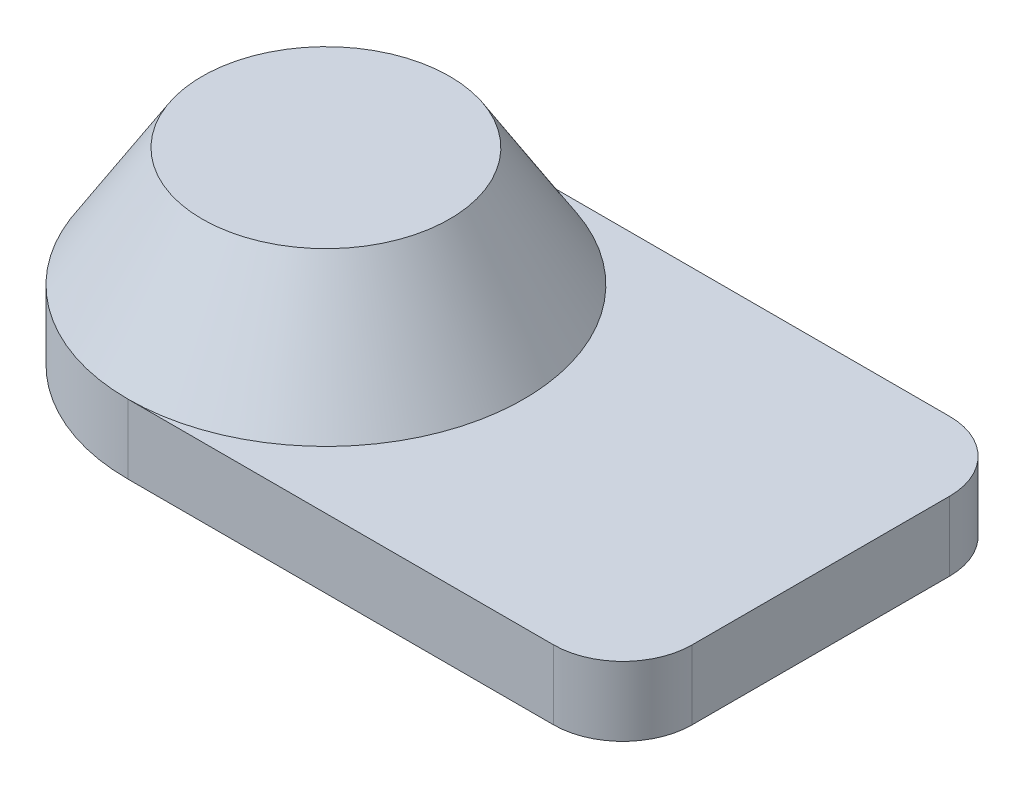
ISO-10303-21;
HEADER;
FILE_DESCRIPTION(('STEP AP214'),'2;1');
FILE_NAME('part.step','',(''),(''),'','','');
FILE_SCHEMA(('AUTOMOTIVE_DESIGN { 1 0 10303 214 1 1 1 1 }'));
ENDSEC;
DATA;
#1=APPLICATION_CONTEXT('core data for automotive mechanical design processes');
#2=APPLICATION_PROTOCOL_DEFINITION('international standard','automotive_design',2000,#1);
#3=PRODUCT_CONTEXT('',#1,'mechanical');
#4=PRODUCT('Part','Part','',(#3));
#5=PRODUCT_RELATED_PRODUCT_CATEGORY('part','',(#4));
#6=PRODUCT_DEFINITION_FORMATION('','',#4);
#7=PRODUCT_DEFINITION_CONTEXT('part definition',#1,'design');
#8=PRODUCT_DEFINITION('design','',#6,#7);
#9=PRODUCT_DEFINITION_SHAPE('','',#8);
#10=(LENGTH_UNIT() NAMED_UNIT(*) SI_UNIT(.MILLI.,.METRE.));
#11=(NAMED_UNIT(*) PLANE_ANGLE_UNIT() SI_UNIT($,.RADIAN.));
#12=(NAMED_UNIT(*) SI_UNIT($,.STERADIAN.) SOLID_ANGLE_UNIT());
#13=UNCERTAINTY_MEASURE_WITH_UNIT(LENGTH_MEASURE(1.E-05),#10,'distance_accuracy_value','');
#14=(GEOMETRIC_REPRESENTATION_CONTEXT(3) GLOBAL_UNCERTAINTY_ASSIGNED_CONTEXT((#13)) GLOBAL_UNIT_ASSIGNED_CONTEXT((#10,
#11,#12)) REPRESENTATION_CONTEXT('',''));
#15=CARTESIAN_POINT('',(0.,0.,0.));
#16=DIRECTION('',(0.,0.,1.));
#17=DIRECTION('',(1.,0.,0.));
#18=AXIS2_PLACEMENT_3D('',#15,#16,#17);
#19=CARTESIAN_POINT('',(0.,8.89,-25.4));
#20=DIRECTION('',(0.,1.,0.));
#21=DIRECTION('',(0.,0.,1.));
#22=AXIS2_PLACEMENT_3D('',#19,#20,#21);
#23=PLANE('',#22);
#24=DIRECTION('',(-1.,0.,0.));
#25=VECTOR('',#24,1.);
#26=CARTESIAN_POINT('',(0.,8.89,-50.8));
#27=LINE('',#26,#25);
#28=CARTESIAN_POINT('',(54.61,8.89,-50.8));
#29=VERTEX_POINT('',#28);
#30=CARTESIAN_POINT('',(0.000274441546231014,8.89,-50.8000000014871));
#31=VERTEX_POINT('',#30);
#32=EDGE_CURVE('E110',#29,#31,#27,.T.);
#33=ORIENTED_EDGE('',*,*,#32,.T.);
#34=CARTESIAN_POINT('',(0.,8.89,-25.4));
#35=DIRECTION('',(0.,1.,0.));
#36=DIRECTION('',(0.,0.,1.));
#37=AXIS2_PLACEMENT_3D('',#34,#35,#36);
#38=CIRCLE('',#37,25.4);
#39=CARTESIAN_POINT('',(0.,8.89,0.));
#40=VERTEX_POINT('',#39);
#41=EDGE_CURVE('E97',#40,#31,#38,.T.);
#42=ORIENTED_EDGE('',*,*,#41,.F.);
#43=DIRECTION('',(1.,0.,0.));
#44=VECTOR('',#43,1.);
#45=CARTESIAN_POINT('',(0.,8.89,0.));
#46=LINE('',#45,#44);
#47=CARTESIAN_POINT('',(54.61,8.89,0.));
#48=VERTEX_POINT('',#47);
#49=EDGE_CURVE('E131',#40,#48,#46,.T.);
#50=ORIENTED_EDGE('',*,*,#49,.T.);
#51=CARTESIAN_POINT('',(54.61,8.89,-8.89));
#52=DIRECTION('',(0.,1.,0.));
#53=DIRECTION('',(0.,0.,1.));
#54=AXIS2_PLACEMENT_3D('',#51,#52,#53);
#55=CIRCLE('',#54,8.89);
#56=CARTESIAN_POINT('',(63.5,8.89,-8.89));
#57=VERTEX_POINT('',#56);
#58=EDGE_CURVE('E196',#48,#57,#55,.T.);
#59=ORIENTED_EDGE('',*,*,#58,.T.);
#60=DIRECTION('',(0.,0.,-1.));
#61=VECTOR('',#60,1.);
#62=CARTESIAN_POINT('',(63.5,8.89,0.));
#63=LINE('',#62,#61);
#64=CARTESIAN_POINT('',(63.5,8.89,-41.91));
#65=VERTEX_POINT('',#64);
#66=EDGE_CURVE('E117',#57,#65,#63,.T.);
#67=ORIENTED_EDGE('',*,*,#66,.T.);
#68=CARTESIAN_POINT('',(54.61,8.89,-41.91));
#69=DIRECTION('',(0.,1.,0.));
#70=DIRECTION('',(0.,0.,1.));
#71=AXIS2_PLACEMENT_3D('',#68,#69,#70);
#72=CIRCLE('',#71,8.89);
#73=EDGE_CURVE('E50',#65,#29,#72,.T.);
#74=ORIENTED_EDGE('',*,*,#73,.T.);
#75=EDGE_LOOP('',(#33,#42,#50,#59,#67,#74));
#76=FACE_BOUND('',#75,.T.);
#77=ADVANCED_FACE('F41',(#76),#23,.T.);
#78=CARTESIAN_POINT('',(0.,8.89,-25.4));
#79=DIRECTION('',(0.,-1.,0.));
#80=DIRECTION('',(0.,0.,-1.));
#81=AXIS2_PLACEMENT_3D('',#78,#79,#80);
#82=CYLINDRICAL_SURFACE('',#81,25.4);
#83=CARTESIAN_POINT('',(0.,0.,-25.4));
#84=DIRECTION('',(0.,1.,0.));
#85=DIRECTION('',(0.,0.,1.));
#86=AXIS2_PLACEMENT_3D('',#83,#84,#85);
#87=CIRCLE('',#86,25.4);
#88=CARTESIAN_POINT('',(0.,0.,-50.8));
#89=VERTEX_POINT('',#88);
#90=CARTESIAN_POINT('',(0.,0.,0.));
#91=VERTEX_POINT('',#90);
#92=EDGE_CURVE('E207',#89,#91,#87,.T.);
#93=ORIENTED_EDGE('',*,*,#92,.T.);
#94=DIRECTION('',(0.,-1.,0.));
#95=VECTOR('',#94,1.);
#96=CARTESIAN_POINT('',(0.,8.89,0.));
#97=LINE('',#96,#95);
#98=EDGE_CURVE('E126',#40,#91,#97,.T.);
#99=ORIENTED_EDGE('',*,*,#98,.F.);
#100=CARTESIAN_POINT('',(0.,8.89,-25.4));
#101=DIRECTION('',(0.,-1.,0.));
#102=DIRECTION('',(0.,0.,-1.));
#103=AXIS2_PLACEMENT_3D('',#100,#101,#102);
#104=CIRCLE('',#103,25.4);
#105=EDGE_CURVE('E103',#31,#40,#104,.F.);
#106=ORIENTED_EDGE('',*,*,#105,.F.);
#107=DIRECTION('',(0.,-1.,0.));
#108=VECTOR('',#107,1.);
#109=CARTESIAN_POINT('',(0.,8.89,-50.8));
#110=LINE('',#109,#108);
#111=EDGE_CURVE('E116',#31,#89,#110,.T.);
#112=ORIENTED_EDGE('',*,*,#111,.T.);
#113=EDGE_LOOP('',(#93,#99,#106,#112));
#114=FACE_BOUND('',#113,.T.);
#115=ADVANCED_FACE('F129',(#114),#82,.T.);
#116=CARTESIAN_POINT('',(0.,8.89,0.));
#117=DIRECTION('',(0.,0.,-1.));
#118=DIRECTION('',(-1.,0.,0.));
#119=AXIS2_PLACEMENT_3D('',#116,#117,#118);
#120=PLANE('',#119);
#121=DIRECTION('',(1.,0.,0.));
#122=VECTOR('',#121,1.);
#123=CARTESIAN_POINT('',(0.,0.,0.));
#124=LINE('',#123,#122);
#125=CARTESIAN_POINT('',(54.61,0.,0.));
#126=VERTEX_POINT('',#125);
#127=EDGE_CURVE('E205',#91,#126,#124,.T.);
#128=ORIENTED_EDGE('',*,*,#127,.T.);
#129=DIRECTION('',(0.,-1.,0.));
#130=VECTOR('',#129,1.);
#131=CARTESIAN_POINT('',(54.61,8.89,0.));
#132=LINE('',#131,#130);
#133=EDGE_CURVE('E12',#126,#48,#132,.F.);
#134=ORIENTED_EDGE('',*,*,#133,.T.);
#135=ORIENTED_EDGE('',*,*,#49,.F.);
#136=ORIENTED_EDGE('',*,*,#98,.T.);
#137=EDGE_LOOP('',(#128,#134,#135,#136));
#138=FACE_BOUND('',#137,.T.);
#139=ADVANCED_FACE('F206',(#138),#120,.F.);
#140=CARTESIAN_POINT('',(63.5,8.89,0.));
#141=DIRECTION('',(-1.,0.,0.));
#142=DIRECTION('',(0.,0.,1.));
#143=AXIS2_PLACEMENT_3D('',#140,#141,#142);
#144=PLANE('',#143);
#145=DIRECTION('',(0.,0.,-1.));
#146=VECTOR('',#145,1.);
#147=CARTESIAN_POINT('',(63.5,0.,0.));
#148=LINE('',#147,#146);
#149=CARTESIAN_POINT('',(63.5,0.,-8.89));
#150=VERTEX_POINT('',#149);
#151=CARTESIAN_POINT('',(63.5,0.,-41.91));
#152=VERTEX_POINT('',#151);
#153=EDGE_CURVE('E133',#150,#152,#148,.T.);
#154=ORIENTED_EDGE('',*,*,#153,.T.);
#155=DIRECTION('',(0.,-1.,0.));
#156=VECTOR('',#155,1.);
#157=CARTESIAN_POINT('',(63.5,8.89,-41.91));
#158=LINE('',#157,#156);
#159=EDGE_CURVE('E64',#152,#65,#158,.F.);
#160=ORIENTED_EDGE('',*,*,#159,.T.);
#161=ORIENTED_EDGE('',*,*,#66,.F.);
#162=DIRECTION('',(0.,-1.,0.));
#163=VECTOR('',#162,1.);
#164=CARTESIAN_POINT('',(63.5,8.89,-8.89));
#165=LINE('',#164,#163);
#166=EDGE_CURVE('E192',#57,#150,#165,.T.);
#167=ORIENTED_EDGE('',*,*,#166,.T.);
#168=EDGE_LOOP('',(#154,#160,#161,#167));
#169=FACE_BOUND('',#168,.T.);
#170=ADVANCED_FACE('F201',(#169),#144,.F.);
#171=CARTESIAN_POINT('',(0.,8.89,-50.8));
#172=DIRECTION('',(0.,0.,1.));
#173=DIRECTION('',(1.,0.,0.));
#174=AXIS2_PLACEMENT_3D('',#171,#172,#173);
#175=PLANE('',#174);
#176=ORIENTED_EDGE('',*,*,#32,.F.);
#177=DIRECTION('',(0.,-1.,0.));
#178=VECTOR('',#177,1.);
#179=CARTESIAN_POINT('',(54.61,8.89,-50.8));
#180=LINE('',#179,#178);
#181=CARTESIAN_POINT('',(54.61,0.,-50.8));
#182=VERTEX_POINT('',#181);
#183=EDGE_CURVE('E184',#29,#182,#180,.T.);
#184=ORIENTED_EDGE('',*,*,#183,.T.);
#185=DIRECTION('',(-1.,0.,0.));
#186=VECTOR('',#185,1.);
#187=CARTESIAN_POINT('',(0.,0.,-50.8));
#188=LINE('',#187,#186);
#189=EDGE_CURVE('E122',#182,#89,#188,.T.);
#190=ORIENTED_EDGE('',*,*,#189,.T.);
#191=ORIENTED_EDGE('',*,*,#111,.F.);
#192=EDGE_LOOP('',(#176,#184,#190,#191));
#193=FACE_BOUND('',#192,.T.);
#194=ADVANCED_FACE('F120',(#193),#175,.F.);
#195=CARTESIAN_POINT('',(0.,0.,-25.4));
#196=DIRECTION('',(0.,1.,0.));
#197=DIRECTION('',(0.,0.,1.));
#198=AXIS2_PLACEMENT_3D('',#195,#196,#197);
#199=PLANE('',#198);
#200=ORIENTED_EDGE('',*,*,#189,.F.);
#201=CARTESIAN_POINT('',(54.61,0.,-41.91));
#202=DIRECTION('',(0.,1.,0.));
#203=DIRECTION('',(0.,0.,1.));
#204=AXIS2_PLACEMENT_3D('',#201,#202,#203);
#205=CIRCLE('',#204,8.89);
#206=EDGE_CURVE('E187',#182,#152,#205,.F.);
#207=ORIENTED_EDGE('',*,*,#206,.T.);
#208=ORIENTED_EDGE('',*,*,#153,.F.);
#209=CARTESIAN_POINT('',(54.61,0.,-8.89));
#210=DIRECTION('',(0.,1.,0.));
#211=DIRECTION('',(0.,0.,1.));
#212=AXIS2_PLACEMENT_3D('',#209,#210,#211);
#213=CIRCLE('',#212,8.89);
#214=EDGE_CURVE('E185',#150,#126,#213,.F.);
#215=ORIENTED_EDGE('',*,*,#214,.T.);
#216=ORIENTED_EDGE('',*,*,#127,.F.);
#217=ORIENTED_EDGE('',*,*,#92,.F.);
#218=EDGE_LOOP('',(#200,#207,#208,#215,#216,#217));
#219=FACE_BOUND('',#218,.T.);
#220=ADVANCED_FACE('F168',(#219),#199,.F.);
#221=CARTESIAN_POINT('',(54.61,8.89,-41.91));
#222=DIRECTION('',(0.,-1.,0.));
#223=DIRECTION('',(0.,0.,-1.));
#224=AXIS2_PLACEMENT_3D('',#221,#222,#223);
#225=CYLINDRICAL_SURFACE('',#224,8.89);
#226=ORIENTED_EDGE('',*,*,#73,.F.);
#227=ORIENTED_EDGE('',*,*,#159,.F.);
#228=ORIENTED_EDGE('',*,*,#206,.F.);
#229=ORIENTED_EDGE('',*,*,#183,.F.);
#230=EDGE_LOOP('',(#226,#227,#228,#229));
#231=FACE_BOUND('',#230,.T.);
#232=ADVANCED_FACE('F212',(#231),#225,.T.);
#233=CARTESIAN_POINT('',(54.61,8.89,-8.89));
#234=DIRECTION('',(0.,-1.,0.));
#235=DIRECTION('',(0.,0.,-1.));
#236=AXIS2_PLACEMENT_3D('',#233,#234,#235);
#237=CYLINDRICAL_SURFACE('',#236,8.89);
#238=ORIENTED_EDGE('',*,*,#58,.F.);
#239=ORIENTED_EDGE('',*,*,#133,.F.);
#240=ORIENTED_EDGE('',*,*,#214,.F.);
#241=ORIENTED_EDGE('',*,*,#166,.F.);
#242=EDGE_LOOP('',(#238,#239,#240,#241));
#243=FACE_BOUND('',#242,.T.);
#244=ADVANCED_FACE('F43',(#243),#237,.T.);
#245=CARTESIAN_POINT('',(0.,24.13,-25.4));
#246=DIRECTION('',(0.,1.,0.));
#247=DIRECTION('',(0.,0.,1.));
#248=AXIS2_PLACEMENT_3D('',#245,#246,#247);
#249=PLANE('',#248);
#250=CARTESIAN_POINT('',(0.,24.13,-25.4));
#251=DIRECTION('',(0.,1.,0.));
#252=DIRECTION('',(0.,0.,1.));
#253=AXIS2_PLACEMENT_3D('',#250,#251,#252);
#254=CIRCLE('',#253,15.875);
#255=CARTESIAN_POINT('',(0.,24.13,-9.525));
#256=VERTEX_POINT('',#255);
#257=EDGE_CURVE('E106',#256,#256,#254,.T.);
#258=ORIENTED_EDGE('',*,*,#257,.T.);
#259=EDGE_LOOP('',(#258));
#260=FACE_BOUND('',#259,.T.);
#261=ADVANCED_FACE('F155',(#260),#249,.T.);
#262=CARTESIAN_POINT('',(0.,24.13,-25.4));
#263=DIRECTION('',(0.,-1.,0.));
#264=DIRECTION('',(0.,0.,-1.));
#265=AXIS2_PLACEMENT_3D('',#262,#263,#264);
#266=CONICAL_SURFACE('',#265,15.875,0.558599315343562);
#267=ORIENTED_EDGE('',*,*,#41,.T.);
#268=ORIENTED_EDGE('',*,*,#105,.T.);
#269=EDGE_LOOP('',(#267,#268));
#270=FACE_BOUND('',#269,.T.);
#271=ORIENTED_EDGE('',*,*,#257,.F.);
#272=EDGE_LOOP('',(#271));
#273=FACE_BOUND('',#272,.T.);
#274=ADVANCED_FACE('F100',(#270,#273),#266,.T.);
#275=CLOSED_SHELL('',(#77,#115,#139,#170,#194,#220,#232,#244,#261,#274));
#276=MANIFOLD_SOLID_BREP('B2',#275);
#277=ADVANCED_BREP_SHAPE_REPRESENTATION('',(#18,#276),#14);
#278=SHAPE_DEFINITION_REPRESENTATION(#9,#277);
ENDSEC;
END-ISO-10303-21;
